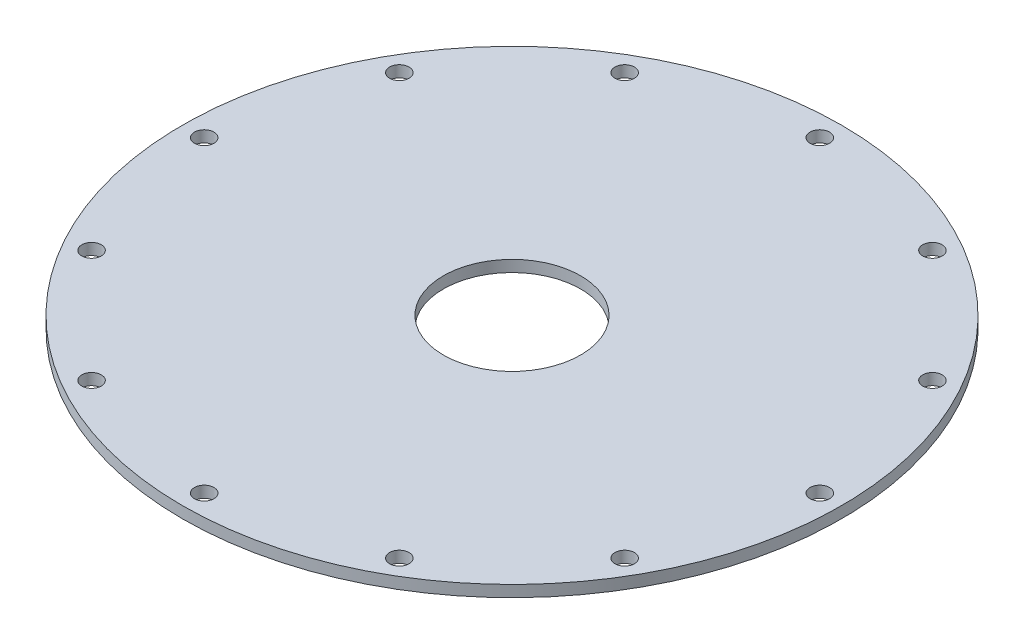
ISO-10303-21;
HEADER;
FILE_DESCRIPTION(('STEP AP214'),'2;1');
FILE_NAME('part.step','',(''),(''),'','','');
FILE_SCHEMA(('AUTOMOTIVE_DESIGN { 1 0 10303 214 1 1 1 1 }'));
ENDSEC;
DATA;
#1=APPLICATION_CONTEXT('core data for automotive mechanical design processes');
#2=APPLICATION_PROTOCOL_DEFINITION('international standard','automotive_design',2000,#1);
#3=PRODUCT_CONTEXT('',#1,'mechanical');
#4=PRODUCT('Part','Part','',(#3));
#5=PRODUCT_RELATED_PRODUCT_CATEGORY('part','',(#4));
#6=PRODUCT_DEFINITION_FORMATION('','',#4);
#7=PRODUCT_DEFINITION_CONTEXT('part definition',#1,'design');
#8=PRODUCT_DEFINITION('design','',#6,#7);
#9=PRODUCT_DEFINITION_SHAPE('','',#8);
#10=(LENGTH_UNIT() NAMED_UNIT(*) SI_UNIT(.MILLI.,.METRE.));
#11=(NAMED_UNIT(*) PLANE_ANGLE_UNIT() SI_UNIT($,.RADIAN.));
#12=(NAMED_UNIT(*) SI_UNIT($,.STERADIAN.) SOLID_ANGLE_UNIT());
#13=UNCERTAINTY_MEASURE_WITH_UNIT(LENGTH_MEASURE(1.E-05),#10,'distance_accuracy_value','');
#14=(GEOMETRIC_REPRESENTATION_CONTEXT(3) GLOBAL_UNCERTAINTY_ASSIGNED_CONTEXT((#13)) GLOBAL_UNIT_ASSIGNED_CONTEXT((#10,
#11,#12)) REPRESENTATION_CONTEXT('',''));
#15=CARTESIAN_POINT('',(0.,0.,0.));
#16=DIRECTION('',(0.,0.,1.));
#17=DIRECTION('',(1.,0.,0.));
#18=AXIS2_PLACEMENT_3D('',#15,#16,#17);
#19=CARTESIAN_POINT('',(-45.72,0.,0.));
#20=DIRECTION('',(0.,-1.,0.));
#21=DIRECTION('',(0.,0.,-1.));
#22=AXIS2_PLACEMENT_3D('',#19,#20,#21);
#23=PLANE('',#22);
#24=CARTESIAN_POINT('',(-36.9797827062029,0.,21.3502874999996));
#25=DIRECTION('',(0.,1.,0.));
#26=DIRECTION('',(0.,0.,1.));
#27=AXIS2_PLACEMENT_3D('',#24,#25,#26);
#28=CIRCLE('',#27,1.35255);
#29=CARTESIAN_POINT('',(-36.9797827062029,0.,22.7028374999996));
#30=VERTEX_POINT('',#29);
#31=EDGE_CURVE('E118',#30,#30,#28,.T.);
#32=ORIENTED_EDGE('',*,*,#31,.T.);
#33=EDGE_LOOP('',(#32));
#34=FACE_BOUND('',#33,.T.);
#35=CARTESIAN_POINT('',(-21.3502875000004,0.,36.9797827062025));
#36=DIRECTION('',(0.,1.,0.));
#37=DIRECTION('',(0.,0.,1.));
#38=AXIS2_PLACEMENT_3D('',#35,#36,#37);
#39=CIRCLE('',#38,1.35255);
#40=CARTESIAN_POINT('',(-21.3502875000004,0.,38.3323327062025));
#41=VERTEX_POINT('',#40);
#42=EDGE_CURVE('E112',#41,#41,#39,.T.);
#43=ORIENTED_EDGE('',*,*,#42,.T.);
#44=EDGE_LOOP('',(#43));
#45=FACE_BOUND('',#44,.T.);
#46=CARTESIAN_POINT('',(36.9797827062028,0.,-21.3502874999998));
#47=DIRECTION('',(0.,1.,0.));
#48=DIRECTION('',(0.,0.,1.));
#49=AXIS2_PLACEMENT_3D('',#46,#47,#48);
#50=CIRCLE('',#49,1.35255);
#51=CARTESIAN_POINT('',(36.9797827062028,0.,-19.9977374999998));
#52=VERTEX_POINT('',#51);
#53=EDGE_CURVE('E82',#52,#52,#50,.T.);
#54=ORIENTED_EDGE('',*,*,#53,.T.);
#55=EDGE_LOOP('',(#54));
#56=FACE_BOUND('',#55,.T.);
#57=CARTESIAN_POINT('',(21.3502875000001,0.,-36.9797827062026));
#58=DIRECTION('',(0.,1.,0.));
#59=DIRECTION('',(0.,0.,1.));
#60=AXIS2_PLACEMENT_3D('',#57,#58,#59);
#61=CIRCLE('',#60,1.35255);
#62=CARTESIAN_POINT('',(21.3502875000001,0.,-35.6272327062026));
#63=VERTEX_POINT('',#62);
#64=EDGE_CURVE('E76',#63,#63,#61,.T.);
#65=ORIENTED_EDGE('',*,*,#64,.T.);
#66=EDGE_LOOP('',(#65));
#67=FACE_BOUND('',#66,.T.);
#68=CARTESIAN_POINT('',(1.15414651602981E-13,0.,-42.700575));
#69=DIRECTION('',(0.,1.,0.));
#70=DIRECTION('',(0.,0.,1.));
#71=AXIS2_PLACEMENT_3D('',#68,#69,#70);
#72=CIRCLE('',#71,1.35255);
#73=CARTESIAN_POINT('',(1.15414651602981E-13,0.,-41.348025));
#74=VERTEX_POINT('',#73);
#75=EDGE_CURVE('E70',#74,#74,#72,.T.);
#76=ORIENTED_EDGE('',*,*,#75,.T.);
#77=EDGE_LOOP('',(#76));
#78=FACE_BOUND('',#77,.T.);
#79=CARTESIAN_POINT('',(-21.3502874999999,0.,-36.9797827062027));
#80=DIRECTION('',(0.,1.,0.));
#81=DIRECTION('',(0.,0.,1.));
#82=AXIS2_PLACEMENT_3D('',#79,#80,#81);
#83=CIRCLE('',#82,1.35255);
#84=CARTESIAN_POINT('',(-21.3502874999999,0.,-35.6272327062027));
#85=VERTEX_POINT('',#84);
#86=EDGE_CURVE('E64',#85,#85,#83,.T.);
#87=ORIENTED_EDGE('',*,*,#86,.T.);
#88=EDGE_LOOP('',(#87));
#89=FACE_BOUND('',#88,.T.);
#90=CARTESIAN_POINT('',(-36.9797827062027,0.,-21.3502875));
#91=DIRECTION('',(0.,1.,0.));
#92=DIRECTION('',(0.,0.,1.));
#93=AXIS2_PLACEMENT_3D('',#90,#91,#92);
#94=CIRCLE('',#93,1.35255);
#95=CARTESIAN_POINT('',(-36.9797827062027,0.,-19.9977375));
#96=VERTEX_POINT('',#95);
#97=EDGE_CURVE('E58',#96,#96,#94,.T.);
#98=ORIENTED_EDGE('',*,*,#97,.T.);
#99=EDGE_LOOP('',(#98));
#100=FACE_BOUND('',#99,.T.);
#101=CARTESIAN_POINT('',(-42.700575,0.,0.));
#102=DIRECTION('',(0.,1.,0.));
#103=DIRECTION('',(0.,0.,1.));
#104=AXIS2_PLACEMENT_3D('',#101,#102,#103);
#105=CIRCLE('',#104,1.35255);
#106=CARTESIAN_POINT('',(-42.700575,0.,1.35255000000001));
#107=VERTEX_POINT('',#106);
#108=EDGE_CURVE('E52',#107,#107,#105,.T.);
#109=ORIENTED_EDGE('',*,*,#108,.T.);
#110=EDGE_LOOP('',(#109));
#111=FACE_BOUND('',#110,.T.);
#112=CARTESIAN_POINT('',(0.,0.,0.));
#113=DIRECTION('',(0.,1.,0.));
#114=DIRECTION('',(0.,0.,1.));
#115=AXIS2_PLACEMENT_3D('',#112,#113,#114);
#116=CIRCLE('',#115,9.525);
#117=CARTESIAN_POINT('',(0.,0.,9.525));
#118=VERTEX_POINT('',#117);
#119=EDGE_CURVE('E43',#118,#118,#116,.T.);
#120=ORIENTED_EDGE('',*,*,#119,.T.);
#121=EDGE_LOOP('',(#120));
#122=FACE_BOUND('',#121,.T.);
#123=CARTESIAN_POINT('',(0.,0.,0.));
#124=DIRECTION('',(0.,1.,0.));
#125=DIRECTION('',(0.,0.,1.));
#126=AXIS2_PLACEMENT_3D('',#123,#124,#125);
#127=CIRCLE('',#126,45.72);
#128=CARTESIAN_POINT('',(0.,0.,45.72));
#129=VERTEX_POINT('',#128);
#130=EDGE_CURVE('E47',#129,#129,#127,.T.);
#131=ORIENTED_EDGE('',*,*,#130,.F.);
#132=EDGE_LOOP('',(#131));
#133=FACE_BOUND('',#132,.T.);
#134=CARTESIAN_POINT('',(42.700575,0.,2.36058615455513E-13));
#135=DIRECTION('',(0.,1.,0.));
#136=DIRECTION('',(0.,0.,1.));
#137=AXIS2_PLACEMENT_3D('',#134,#135,#136);
#138=CIRCLE('',#137,1.35255);
#139=CARTESIAN_POINT('',(42.700575,0.,1.35255000000024));
#140=VERTEX_POINT('',#139);
#141=EDGE_CURVE('E88',#140,#140,#138,.T.);
#142=ORIENTED_EDGE('',*,*,#141,.T.);
#143=EDGE_LOOP('',(#142));
#144=FACE_BOUND('',#143,.T.);
#145=CARTESIAN_POINT('',(36.9797827062026,0.,21.3502875000002));
#146=DIRECTION('',(0.,1.,0.));
#147=DIRECTION('',(0.,0.,1.));
#148=AXIS2_PLACEMENT_3D('',#145,#146,#147);
#149=CIRCLE('',#148,1.35255);
#150=CARTESIAN_POINT('',(36.9797827062026,0.,22.7028375000002));
#151=VERTEX_POINT('',#150);
#152=EDGE_CURVE('E94',#151,#151,#149,.T.);
#153=ORIENTED_EDGE('',*,*,#152,.T.);
#154=EDGE_LOOP('',(#153));
#155=FACE_BOUND('',#154,.T.);
#156=CARTESIAN_POINT('',(21.3502874999997,0.,36.9797827062029));
#157=DIRECTION('',(0.,1.,0.));
#158=DIRECTION('',(0.,0.,1.));
#159=AXIS2_PLACEMENT_3D('',#156,#157,#158);
#160=CIRCLE('',#159,1.35255);
#161=CARTESIAN_POINT('',(21.3502874999997,0.,38.3323327062029));
#162=VERTEX_POINT('',#161);
#163=EDGE_CURVE('E100',#162,#162,#160,.T.);
#164=ORIENTED_EDGE('',*,*,#163,.T.);
#165=EDGE_LOOP('',(#164));
#166=FACE_BOUND('',#165,.T.);
#167=CARTESIAN_POINT('',(-3.66184011613991E-13,0.,42.700575));
#168=DIRECTION('',(0.,1.,0.));
#169=DIRECTION('',(0.,0.,1.));
#170=AXIS2_PLACEMENT_3D('',#167,#168,#169);
#171=CIRCLE('',#170,1.35255);
#172=CARTESIAN_POINT('',(-3.66184011613991E-13,0.,44.053125));
#173=VERTEX_POINT('',#172);
#174=EDGE_CURVE('E106',#173,#173,#171,.T.);
#175=ORIENTED_EDGE('',*,*,#174,.T.);
#176=EDGE_LOOP('',(#175));
#177=FACE_BOUND('',#176,.T.);
#178=ADVANCED_FACE('F32',(#34,#45,#56,#67,#78,#89,#100,#111,#122,#133,#144,#155,#166,#177),#23,.T.);
#179=CARTESIAN_POINT('',(0.,55.,0.));
#180=DIRECTION('',(0.,1.,0.));
#181=DIRECTION('',(0.,0.,1.));
#182=AXIS2_PLACEMENT_3D('',#179,#180,#181);
#183=CYLINDRICAL_SURFACE('',#182,45.72);
#184=ORIENTED_EDGE('',*,*,#130,.T.);
#185=EDGE_LOOP('',(#184));
#186=FACE_BOUND('',#185,.T.);
#187=CARTESIAN_POINT('',(0.,1.5875,0.));
#188=DIRECTION('',(0.,1.,0.));
#189=DIRECTION('',(0.,0.,1.));
#190=AXIS2_PLACEMENT_3D('',#187,#188,#189);
#191=CIRCLE('',#190,45.72);
#192=CARTESIAN_POINT('',(0.,1.5875,45.72));
#193=VERTEX_POINT('',#192);
#194=EDGE_CURVE('E10',#193,#193,#191,.T.);
#195=ORIENTED_EDGE('',*,*,#194,.F.);
#196=EDGE_LOOP('',(#195));
#197=FACE_BOUND('',#196,.T.);
#198=ADVANCED_FACE('F34',(#186,#197),#183,.T.);
#199=CARTESIAN_POINT('',(-45.72,1.5875,0.));
#200=DIRECTION('',(0.,1.,0.));
#201=DIRECTION('',(0.,0.,1.));
#202=AXIS2_PLACEMENT_3D('',#199,#200,#201);
#203=PLANE('',#202);
#204=CARTESIAN_POINT('',(-36.9797827062029,1.5875,21.3502874999996));
#205=DIRECTION('',(0.,1.,0.));
#206=DIRECTION('',(0.,0.,1.));
#207=AXIS2_PLACEMENT_3D('',#204,#205,#206);
#208=CIRCLE('',#207,1.35255);
#209=CARTESIAN_POINT('',(-36.9797827062029,1.5875,22.7028374999996));
#210=VERTEX_POINT('',#209);
#211=EDGE_CURVE('E121',#210,#210,#208,.T.);
#212=ORIENTED_EDGE('',*,*,#211,.F.);
#213=EDGE_LOOP('',(#212));
#214=FACE_BOUND('',#213,.T.);
#215=CARTESIAN_POINT('',(-21.3502875000004,1.5875,36.9797827062025));
#216=DIRECTION('',(0.,1.,0.));
#217=DIRECTION('',(0.,0.,1.));
#218=AXIS2_PLACEMENT_3D('',#215,#216,#217);
#219=CIRCLE('',#218,1.35255);
#220=CARTESIAN_POINT('',(-21.3502875000004,1.5875,38.3323327062025));
#221=VERTEX_POINT('',#220);
#222=EDGE_CURVE('E115',#221,#221,#219,.T.);
#223=ORIENTED_EDGE('',*,*,#222,.F.);
#224=EDGE_LOOP('',(#223));
#225=FACE_BOUND('',#224,.T.);
#226=CARTESIAN_POINT('',(-3.66184011613991E-13,1.5875,42.700575));
#227=DIRECTION('',(0.,1.,0.));
#228=DIRECTION('',(0.,0.,1.));
#229=AXIS2_PLACEMENT_3D('',#226,#227,#228);
#230=CIRCLE('',#229,1.35255);
#231=CARTESIAN_POINT('',(-3.66184011613991E-13,1.5875,44.053125));
#232=VERTEX_POINT('',#231);
#233=EDGE_CURVE('E109',#232,#232,#230,.T.);
#234=ORIENTED_EDGE('',*,*,#233,.F.);
#235=EDGE_LOOP('',(#234));
#236=FACE_BOUND('',#235,.T.);
#237=CARTESIAN_POINT('',(21.3502874999997,1.5875,36.9797827062029));
#238=DIRECTION('',(0.,1.,0.));
#239=DIRECTION('',(0.,0.,1.));
#240=AXIS2_PLACEMENT_3D('',#237,#238,#239);
#241=CIRCLE('',#240,1.35255);
#242=CARTESIAN_POINT('',(21.3502874999997,1.5875,38.3323327062029));
#243=VERTEX_POINT('',#242);
#244=EDGE_CURVE('E103',#243,#243,#241,.T.);
#245=ORIENTED_EDGE('',*,*,#244,.F.);
#246=EDGE_LOOP('',(#245));
#247=FACE_BOUND('',#246,.T.);
#248=CARTESIAN_POINT('',(36.9797827062026,1.5875,21.3502875000002));
#249=DIRECTION('',(0.,1.,0.));
#250=DIRECTION('',(0.,0.,1.));
#251=AXIS2_PLACEMENT_3D('',#248,#249,#250);
#252=CIRCLE('',#251,1.35255);
#253=CARTESIAN_POINT('',(36.9797827062026,1.5875,22.7028375000002));
#254=VERTEX_POINT('',#253);
#255=EDGE_CURVE('E97',#254,#254,#252,.T.);
#256=ORIENTED_EDGE('',*,*,#255,.F.);
#257=EDGE_LOOP('',(#256));
#258=FACE_BOUND('',#257,.T.);
#259=CARTESIAN_POINT('',(42.700575,1.5875,2.36058615455513E-13));
#260=DIRECTION('',(0.,1.,0.));
#261=DIRECTION('',(0.,0.,1.));
#262=AXIS2_PLACEMENT_3D('',#259,#260,#261);
#263=CIRCLE('',#262,1.35255);
#264=CARTESIAN_POINT('',(42.700575,1.5875,1.35255000000024));
#265=VERTEX_POINT('',#264);
#266=EDGE_CURVE('E91',#265,#265,#263,.T.);
#267=ORIENTED_EDGE('',*,*,#266,.F.);
#268=EDGE_LOOP('',(#267));
#269=FACE_BOUND('',#268,.T.);
#270=CARTESIAN_POINT('',(36.9797827062028,1.5875,-21.3502874999998));
#271=DIRECTION('',(0.,1.,0.));
#272=DIRECTION('',(0.,0.,1.));
#273=AXIS2_PLACEMENT_3D('',#270,#271,#272);
#274=CIRCLE('',#273,1.35255);
#275=CARTESIAN_POINT('',(36.9797827062028,1.5875,-19.9977374999998));
#276=VERTEX_POINT('',#275);
#277=EDGE_CURVE('E85',#276,#276,#274,.T.);
#278=ORIENTED_EDGE('',*,*,#277,.F.);
#279=EDGE_LOOP('',(#278));
#280=FACE_BOUND('',#279,.T.);
#281=CARTESIAN_POINT('',(21.3502875000001,1.5875,-36.9797827062026));
#282=DIRECTION('',(0.,1.,0.));
#283=DIRECTION('',(0.,0.,1.));
#284=AXIS2_PLACEMENT_3D('',#281,#282,#283);
#285=CIRCLE('',#284,1.35255);
#286=CARTESIAN_POINT('',(21.3502875000001,1.5875,-35.6272327062026));
#287=VERTEX_POINT('',#286);
#288=EDGE_CURVE('E79',#287,#287,#285,.T.);
#289=ORIENTED_EDGE('',*,*,#288,.F.);
#290=EDGE_LOOP('',(#289));
#291=FACE_BOUND('',#290,.T.);
#292=CARTESIAN_POINT('',(1.15414651602981E-13,1.5875,-42.700575));
#293=DIRECTION('',(0.,1.,0.));
#294=DIRECTION('',(0.,0.,1.));
#295=AXIS2_PLACEMENT_3D('',#292,#293,#294);
#296=CIRCLE('',#295,1.35255);
#297=CARTESIAN_POINT('',(1.15414651602981E-13,1.5875,-41.348025));
#298=VERTEX_POINT('',#297);
#299=EDGE_CURVE('E73',#298,#298,#296,.T.);
#300=ORIENTED_EDGE('',*,*,#299,.F.);
#301=EDGE_LOOP('',(#300));
#302=FACE_BOUND('',#301,.T.);
#303=CARTESIAN_POINT('',(-21.3502874999999,1.5875,-36.9797827062027));
#304=DIRECTION('',(0.,1.,0.));
#305=DIRECTION('',(0.,0.,1.));
#306=AXIS2_PLACEMENT_3D('',#303,#304,#305);
#307=CIRCLE('',#306,1.35255);
#308=CARTESIAN_POINT('',(-21.3502874999999,1.5875,-35.6272327062027));
#309=VERTEX_POINT('',#308);
#310=EDGE_CURVE('E67',#309,#309,#307,.T.);
#311=ORIENTED_EDGE('',*,*,#310,.F.);
#312=EDGE_LOOP('',(#311));
#313=FACE_BOUND('',#312,.T.);
#314=CARTESIAN_POINT('',(-36.9797827062027,1.5875,-21.3502875));
#315=DIRECTION('',(0.,1.,0.));
#316=DIRECTION('',(0.,0.,1.));
#317=AXIS2_PLACEMENT_3D('',#314,#315,#316);
#318=CIRCLE('',#317,1.35255);
#319=CARTESIAN_POINT('',(-36.9797827062027,1.5875,-19.9977375));
#320=VERTEX_POINT('',#319);
#321=EDGE_CURVE('E61',#320,#320,#318,.T.);
#322=ORIENTED_EDGE('',*,*,#321,.F.);
#323=EDGE_LOOP('',(#322));
#324=FACE_BOUND('',#323,.T.);
#325=CARTESIAN_POINT('',(-42.700575,1.5875,0.));
#326=DIRECTION('',(0.,1.,0.));
#327=DIRECTION('',(0.,0.,1.));
#328=AXIS2_PLACEMENT_3D('',#325,#326,#327);
#329=CIRCLE('',#328,1.35255);
#330=CARTESIAN_POINT('',(-42.700575,1.5875,1.35255000000001));
#331=VERTEX_POINT('',#330);
#332=EDGE_CURVE('E55',#331,#331,#329,.T.);
#333=ORIENTED_EDGE('',*,*,#332,.F.);
#334=EDGE_LOOP('',(#333));
#335=FACE_BOUND('',#334,.T.);
#336=ORIENTED_EDGE('',*,*,#194,.T.);
#337=EDGE_LOOP('',(#336));
#338=FACE_BOUND('',#337,.T.);
#339=CARTESIAN_POINT('',(0.,1.5875,0.));
#340=DIRECTION('',(0.,1.,0.));
#341=DIRECTION('',(0.,0.,1.));
#342=AXIS2_PLACEMENT_3D('',#339,#340,#341);
#343=CIRCLE('',#342,9.525);
#344=CARTESIAN_POINT('',(0.,1.5875,9.525));
#345=VERTEX_POINT('',#344);
#346=EDGE_CURVE('E39',#345,#345,#343,.T.);
#347=ORIENTED_EDGE('',*,*,#346,.F.);
#348=EDGE_LOOP('',(#347));
#349=FACE_BOUND('',#348,.T.);
#350=ADVANCED_FACE('F127',(#214,#225,#236,#247,#258,#269,#280,#291,#302,#313,#324,#335,#338,
#349),#203,.T.);
#351=CARTESIAN_POINT('',(0.,55.,0.));
#352=DIRECTION('',(0.,1.,0.));
#353=DIRECTION('',(0.,0.,1.));
#354=AXIS2_PLACEMENT_3D('',#351,#352,#353);
#355=CYLINDRICAL_SURFACE('',#354,9.525);
#356=ORIENTED_EDGE('',*,*,#346,.T.);
#357=EDGE_LOOP('',(#356));
#358=FACE_BOUND('',#357,.T.);
#359=ORIENTED_EDGE('',*,*,#119,.F.);
#360=EDGE_LOOP('',(#359));
#361=FACE_BOUND('',#360,.T.);
#362=ADVANCED_FACE('F130',(#358,#361),#355,.F.);
#363=CARTESIAN_POINT('',(-42.700575,1.5875,0.));
#364=DIRECTION('',(0.,1.,0.));
#365=DIRECTION('',(0.,0.,1.));
#366=AXIS2_PLACEMENT_3D('',#363,#364,#365);
#367=CYLINDRICAL_SURFACE('',#366,1.35255);
#368=ORIENTED_EDGE('',*,*,#108,.F.);
#369=EDGE_LOOP('',(#368));
#370=FACE_BOUND('',#369,.T.);
#371=ORIENTED_EDGE('',*,*,#332,.T.);
#372=EDGE_LOOP('',(#371));
#373=FACE_BOUND('',#372,.T.);
#374=ADVANCED_FACE('F154',(#370,#373),#367,.F.);
#375=CARTESIAN_POINT('',(-36.9797827062027,1.5875,-21.3502875));
#376=DIRECTION('',(0.,1.,0.));
#377=DIRECTION('',(0.,0.,1.));
#378=AXIS2_PLACEMENT_3D('',#375,#376,#377);
#379=CYLINDRICAL_SURFACE('',#378,1.35255);
#380=ORIENTED_EDGE('',*,*,#97,.F.);
#381=EDGE_LOOP('',(#380));
#382=FACE_BOUND('',#381,.T.);
#383=ORIENTED_EDGE('',*,*,#321,.T.);
#384=EDGE_LOOP('',(#383));
#385=FACE_BOUND('',#384,.T.);
#386=ADVANCED_FACE('F156',(#382,#385),#379,.F.);
#387=CARTESIAN_POINT('',(-21.3502874999999,1.5875,-36.9797827062027));
#388=DIRECTION('',(0.,1.,0.));
#389=DIRECTION('',(0.,0.,1.));
#390=AXIS2_PLACEMENT_3D('',#387,#388,#389);
#391=CYLINDRICAL_SURFACE('',#390,1.35255);
#392=ORIENTED_EDGE('',*,*,#86,.F.);
#393=EDGE_LOOP('',(#392));
#394=FACE_BOUND('',#393,.T.);
#395=ORIENTED_EDGE('',*,*,#310,.T.);
#396=EDGE_LOOP('',(#395));
#397=FACE_BOUND('',#396,.T.);
#398=ADVANCED_FACE('F163',(#394,#397),#391,.F.);
#399=CARTESIAN_POINT('',(1.15414651602981E-13,1.5875,-42.700575));
#400=DIRECTION('',(0.,1.,0.));
#401=DIRECTION('',(0.,0.,1.));
#402=AXIS2_PLACEMENT_3D('',#399,#400,#401);
#403=CYLINDRICAL_SURFACE('',#402,1.35255);
#404=ORIENTED_EDGE('',*,*,#75,.F.);
#405=EDGE_LOOP('',(#404));
#406=FACE_BOUND('',#405,.T.);
#407=ORIENTED_EDGE('',*,*,#299,.T.);
#408=EDGE_LOOP('',(#407));
#409=FACE_BOUND('',#408,.T.);
#410=ADVANCED_FACE('F233',(#406,#409),#403,.F.);
#411=CARTESIAN_POINT('',(21.3502875000001,1.5875,-36.9797827062026));
#412=DIRECTION('',(0.,1.,0.));
#413=DIRECTION('',(0.,0.,1.));
#414=AXIS2_PLACEMENT_3D('',#411,#412,#413);
#415=CYLINDRICAL_SURFACE('',#414,1.35255);
#416=ORIENTED_EDGE('',*,*,#64,.F.);
#417=EDGE_LOOP('',(#416));
#418=FACE_BOUND('',#417,.T.);
#419=ORIENTED_EDGE('',*,*,#288,.T.);
#420=EDGE_LOOP('',(#419));
#421=FACE_BOUND('',#420,.T.);
#422=ADVANCED_FACE('F229',(#418,#421),#415,.F.);
#423=CARTESIAN_POINT('',(36.9797827062028,1.5875,-21.3502874999998));
#424=DIRECTION('',(0.,1.,0.));
#425=DIRECTION('',(0.,0.,1.));
#426=AXIS2_PLACEMENT_3D('',#423,#424,#425);
#427=CYLINDRICAL_SURFACE('',#426,1.35255);
#428=ORIENTED_EDGE('',*,*,#53,.F.);
#429=EDGE_LOOP('',(#428));
#430=FACE_BOUND('',#429,.T.);
#431=ORIENTED_EDGE('',*,*,#277,.T.);
#432=EDGE_LOOP('',(#431));
#433=FACE_BOUND('',#432,.T.);
#434=ADVANCED_FACE('F225',(#430,#433),#427,.F.);
#435=CARTESIAN_POINT('',(42.700575,1.5875,2.36058615455513E-13));
#436=DIRECTION('',(0.,1.,0.));
#437=DIRECTION('',(0.,0.,1.));
#438=AXIS2_PLACEMENT_3D('',#435,#436,#437);
#439=CYLINDRICAL_SURFACE('',#438,1.35255);
#440=ORIENTED_EDGE('',*,*,#141,.F.);
#441=EDGE_LOOP('',(#440));
#442=FACE_BOUND('',#441,.T.);
#443=ORIENTED_EDGE('',*,*,#266,.T.);
#444=EDGE_LOOP('',(#443));
#445=FACE_BOUND('',#444,.T.);
#446=ADVANCED_FACE('F221',(#442,#445),#439,.F.);
#447=CARTESIAN_POINT('',(36.9797827062026,1.5875,21.3502875000002));
#448=DIRECTION('',(0.,1.,0.));
#449=DIRECTION('',(0.,0.,1.));
#450=AXIS2_PLACEMENT_3D('',#447,#448,#449);
#451=CYLINDRICAL_SURFACE('',#450,1.35255);
#452=ORIENTED_EDGE('',*,*,#152,.F.);
#453=EDGE_LOOP('',(#452));
#454=FACE_BOUND('',#453,.T.);
#455=ORIENTED_EDGE('',*,*,#255,.T.);
#456=EDGE_LOOP('',(#455));
#457=FACE_BOUND('',#456,.T.);
#458=ADVANCED_FACE('F214',(#454,#457),#451,.F.);
#459=CARTESIAN_POINT('',(21.3502874999997,1.5875,36.9797827062029));
#460=DIRECTION('',(0.,1.,0.));
#461=DIRECTION('',(0.,0.,1.));
#462=AXIS2_PLACEMENT_3D('',#459,#460,#461);
#463=CYLINDRICAL_SURFACE('',#462,1.35255);
#464=ORIENTED_EDGE('',*,*,#163,.F.);
#465=EDGE_LOOP('',(#464));
#466=FACE_BOUND('',#465,.T.);
#467=ORIENTED_EDGE('',*,*,#244,.T.);
#468=EDGE_LOOP('',(#467));
#469=FACE_BOUND('',#468,.T.);
#470=ADVANCED_FACE('F206',(#466,#469),#463,.F.);
#471=CARTESIAN_POINT('',(-3.66184011613991E-13,1.5875,42.700575));
#472=DIRECTION('',(0.,1.,0.));
#473=DIRECTION('',(0.,0.,1.));
#474=AXIS2_PLACEMENT_3D('',#471,#472,#473);
#475=CYLINDRICAL_SURFACE('',#474,1.35255);
#476=ORIENTED_EDGE('',*,*,#174,.F.);
#477=EDGE_LOOP('',(#476));
#478=FACE_BOUND('',#477,.T.);
#479=ORIENTED_EDGE('',*,*,#233,.T.);
#480=EDGE_LOOP('',(#479));
#481=FACE_BOUND('',#480,.T.);
#482=ADVANCED_FACE('F202',(#478,#481),#475,.F.);
#483=CARTESIAN_POINT('',(-21.3502875000004,1.5875,36.9797827062025));
#484=DIRECTION('',(0.,1.,0.));
#485=DIRECTION('',(0.,0.,1.));
#486=AXIS2_PLACEMENT_3D('',#483,#484,#485);
#487=CYLINDRICAL_SURFACE('',#486,1.35255);
#488=ORIENTED_EDGE('',*,*,#42,.F.);
#489=EDGE_LOOP('',(#488));
#490=FACE_BOUND('',#489,.T.);
#491=ORIENTED_EDGE('',*,*,#222,.T.);
#492=EDGE_LOOP('',(#491));
#493=FACE_BOUND('',#492,.T.);
#494=ADVANCED_FACE('F205',(#490,#493),#487,.F.);
#495=CARTESIAN_POINT('',(-36.9797827062029,1.5875,21.3502874999996));
#496=DIRECTION('',(0.,1.,0.));
#497=DIRECTION('',(0.,0.,1.));
#498=AXIS2_PLACEMENT_3D('',#495,#496,#497);
#499=CYLINDRICAL_SURFACE('',#498,1.35255);
#500=ORIENTED_EDGE('',*,*,#31,.F.);
#501=EDGE_LOOP('',(#500));
#502=FACE_BOUND('',#501,.T.);
#503=ORIENTED_EDGE('',*,*,#211,.T.);
#504=EDGE_LOOP('',(#503));
#505=FACE_BOUND('',#504,.T.);
#506=ADVANCED_FACE('F125',(#502,#505),#499,.F.);
#507=CLOSED_SHELL('',(#178,#198,#350,#362,#374,#386,#398,#410,#422,#434,#446,#458,#470,#482,
#494,#506));
#508=MANIFOLD_SOLID_BREP('B2',#507);
#509=ADVANCED_BREP_SHAPE_REPRESENTATION('',(#18,#508),#14);
#510=SHAPE_DEFINITION_REPRESENTATION(#9,#509);
ENDSEC;
END-ISO-10303-21;
